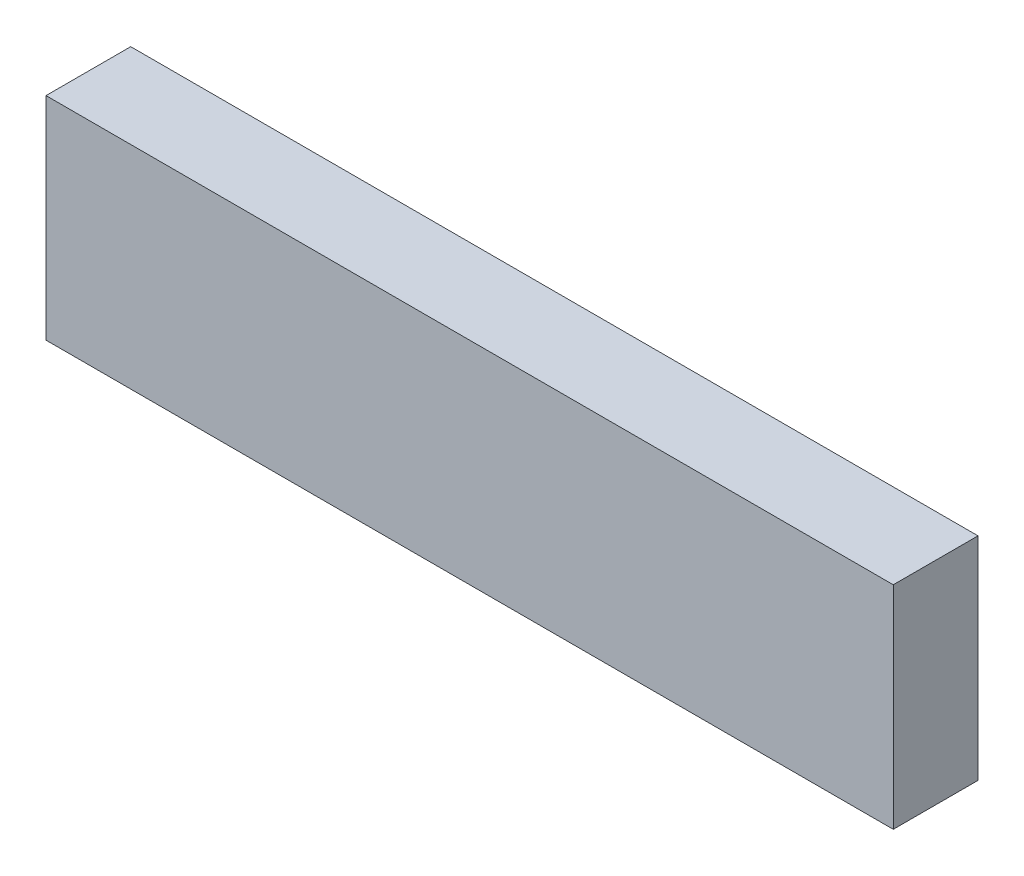
ISO-10303-21;
HEADER;
FILE_DESCRIPTION(('STEP AP214'),'2;1');
FILE_NAME('part.step','',(''),(''),'','','');
FILE_SCHEMA(('AUTOMOTIVE_DESIGN { 1 0 10303 214 1 1 1 1 }'));
ENDSEC;
DATA;
#1=APPLICATION_CONTEXT('core data for automotive mechanical design processes');
#2=APPLICATION_PROTOCOL_DEFINITION('international standard','automotive_design',2000,#1);
#3=PRODUCT_CONTEXT('',#1,'mechanical');
#4=PRODUCT('Part','Part','',(#3));
#5=PRODUCT_RELATED_PRODUCT_CATEGORY('part','',(#4));
#6=PRODUCT_DEFINITION_FORMATION('','',#4);
#7=PRODUCT_DEFINITION_CONTEXT('part definition',#1,'design');
#8=PRODUCT_DEFINITION('design','',#6,#7);
#9=PRODUCT_DEFINITION_SHAPE('','',#8);
#10=(LENGTH_UNIT() NAMED_UNIT(*) SI_UNIT(.MILLI.,.METRE.));
#11=(NAMED_UNIT(*) PLANE_ANGLE_UNIT() SI_UNIT($,.RADIAN.));
#12=(NAMED_UNIT(*) SI_UNIT($,.STERADIAN.) SOLID_ANGLE_UNIT());
#13=UNCERTAINTY_MEASURE_WITH_UNIT(LENGTH_MEASURE(1.E-05),#10,'distance_accuracy_value','');
#14=(GEOMETRIC_REPRESENTATION_CONTEXT(3) GLOBAL_UNCERTAINTY_ASSIGNED_CONTEXT((#13)) GLOBAL_UNIT_ASSIGNED_CONTEXT((#10,
#11,#12)) REPRESENTATION_CONTEXT('',''));
#15=CARTESIAN_POINT('',(0.,0.,0.));
#16=DIRECTION('',(0.,0.,1.));
#17=DIRECTION('',(1.,0.,0.));
#18=AXIS2_PLACEMENT_3D('',#15,#16,#17);
#19=CARTESIAN_POINT('',(-210.,-50.01,55.8));
#20=DIRECTION('',(0.,0.,-1.));
#21=DIRECTION('',(-1.,0.,0.));
#22=AXIS2_PLACEMENT_3D('',#19,#20,#21);
#23=PLANE('',#22);
#24=DIRECTION('',(0.,1.,0.));
#25=VECTOR('',#24,1.);
#26=CARTESIAN_POINT('',(-210.,-50.01,55.8));
#27=LINE('',#26,#25);
#28=CARTESIAN_POINT('',(-210.,-50.,55.8));
#29=VERTEX_POINT('',#28);
#30=CARTESIAN_POINT('',(-210.,-47.,55.8));
#31=VERTEX_POINT('',#30);
#32=EDGE_CURVE('E43',#29,#31,#27,.T.);
#33=ORIENTED_EDGE('',*,*,#32,.T.);
#34=DIRECTION('',(1.,0.,0.));
#35=VECTOR('',#34,1.);
#36=CARTESIAN_POINT('',(-300.,-47.,55.8));
#37=LINE('',#36,#35);
#38=CARTESIAN_POINT('',(-198.,-47.,55.8));
#39=VERTEX_POINT('',#38);
#40=EDGE_CURVE('E92',#31,#39,#37,.T.);
#41=ORIENTED_EDGE('',*,*,#40,.T.);
#42=DIRECTION('',(0.,1.,0.));
#43=VECTOR('',#42,1.);
#44=CARTESIAN_POINT('',(-198.,-50.01,55.8));
#45=LINE('',#44,#43);
#46=CARTESIAN_POINT('',(-198.,-50.,55.8));
#47=VERTEX_POINT('',#46);
#48=EDGE_CURVE('E11',#47,#39,#45,.T.);
#49=ORIENTED_EDGE('',*,*,#48,.F.);
#50=DIRECTION('',(-1.,0.,0.));
#51=VECTOR('',#50,1.);
#52=CARTESIAN_POINT('',(-300.,-50.,55.8));
#53=LINE('',#52,#51);
#54=EDGE_CURVE('E96',#47,#29,#53,.T.);
#55=ORIENTED_EDGE('',*,*,#54,.T.);
#56=EDGE_LOOP('',(#33,#41,#49,#55));
#57=FACE_BOUND('',#56,.T.);
#58=ADVANCED_FACE('F35',(#57),#23,.T.);
#59=CARTESIAN_POINT('',(-210.,-50.01,55.8));
#60=DIRECTION('',(-1.,0.,0.));
#61=DIRECTION('',(0.,0.,1.));
#62=AXIS2_PLACEMENT_3D('',#59,#60,#61);
#63=PLANE('',#62);
#64=DIRECTION('',(0.,1.,0.));
#65=VECTOR('',#64,1.);
#66=CARTESIAN_POINT('',(-210.,-50.01,57.));
#67=LINE('',#66,#65);
#68=CARTESIAN_POINT('',(-210.,-50.,57.));
#69=VERTEX_POINT('',#68);
#70=CARTESIAN_POINT('',(-210.,-47.,57.));
#71=VERTEX_POINT('',#70);
#72=EDGE_CURVE('E71',#69,#71,#67,.T.);
#73=ORIENTED_EDGE('',*,*,#72,.T.);
#74=DIRECTION('',(0.,0.,-1.));
#75=VECTOR('',#74,1.);
#76=CARTESIAN_POINT('',(-210.,-47.,3.));
#77=LINE('',#76,#75);
#78=EDGE_CURVE('E75',#71,#31,#77,.T.);
#79=ORIENTED_EDGE('',*,*,#78,.T.);
#80=ORIENTED_EDGE('',*,*,#32,.F.);
#81=DIRECTION('',(0.,0.,1.));
#82=VECTOR('',#81,1.);
#83=CARTESIAN_POINT('',(-210.,-50.,60.));
#84=LINE('',#83,#82);
#85=EDGE_CURVE('E77',#29,#69,#84,.T.);
#86=ORIENTED_EDGE('',*,*,#85,.T.);
#87=EDGE_LOOP('',(#73,#79,#80,#86));
#88=FACE_BOUND('',#87,.T.);
#89=ADVANCED_FACE('F73',(#88),#63,.T.);
#90=CARTESIAN_POINT('',(-198.,-50.01,55.8));
#91=DIRECTION('',(1.,0.,0.));
#92=DIRECTION('',(0.,0.,-1.));
#93=AXIS2_PLACEMENT_3D('',#90,#91,#92);
#94=PLANE('',#93);
#95=ORIENTED_EDGE('',*,*,#48,.T.);
#96=DIRECTION('',(0.,0.,1.));
#97=VECTOR('',#96,1.);
#98=CARTESIAN_POINT('',(-198.,-47.,3.));
#99=LINE('',#98,#97);
#100=CARTESIAN_POINT('',(-198.,-47.,57.));
#101=VERTEX_POINT('',#100);
#102=EDGE_CURVE('E89',#39,#101,#99,.T.);
#103=ORIENTED_EDGE('',*,*,#102,.T.);
#104=DIRECTION('',(0.,1.,0.));
#105=VECTOR('',#104,1.);
#106=CARTESIAN_POINT('',(-198.,-50.01,57.));
#107=LINE('',#106,#105);
#108=CARTESIAN_POINT('',(-198.,-50.,57.));
#109=VERTEX_POINT('',#108);
#110=EDGE_CURVE('E81',#109,#101,#107,.T.);
#111=ORIENTED_EDGE('',*,*,#110,.F.);
#112=DIRECTION('',(0.,0.,-1.));
#113=VECTOR('',#112,1.);
#114=CARTESIAN_POINT('',(-198.,-50.,60.));
#115=LINE('',#114,#113);
#116=EDGE_CURVE('E100',#109,#47,#115,.T.);
#117=ORIENTED_EDGE('',*,*,#116,.T.);
#118=EDGE_LOOP('',(#95,#103,#111,#117));
#119=FACE_BOUND('',#118,.T.);
#120=ADVANCED_FACE('F109',(#119),#94,.T.);
#121=CARTESIAN_POINT('',(-210.,-50.01,57.));
#122=DIRECTION('',(0.,0.,1.));
#123=DIRECTION('',(1.,0.,0.));
#124=AXIS2_PLACEMENT_3D('',#121,#122,#123);
#125=PLANE('',#124);
#126=ORIENTED_EDGE('',*,*,#110,.T.);
#127=DIRECTION('',(-1.,0.,0.));
#128=VECTOR('',#127,1.);
#129=CARTESIAN_POINT('',(-300.,-47.,57.));
#130=LINE('',#129,#128);
#131=EDGE_CURVE('E84',#101,#71,#130,.T.);
#132=ORIENTED_EDGE('',*,*,#131,.T.);
#133=ORIENTED_EDGE('',*,*,#72,.F.);
#134=DIRECTION('',(1.,0.,0.));
#135=VECTOR('',#134,1.);
#136=CARTESIAN_POINT('',(-300.,-50.,57.));
#137=LINE('',#136,#135);
#138=EDGE_CURVE('E103',#69,#109,#137,.T.);
#139=ORIENTED_EDGE('',*,*,#138,.T.);
#140=EDGE_LOOP('',(#126,#132,#133,#139));
#141=FACE_BOUND('',#140,.T.);
#142=ADVANCED_FACE('F85',(#141),#125,.T.);
#143=CARTESIAN_POINT('',(-300.,-50.,60.));
#144=DIRECTION('',(0.,1.,0.));
#145=DIRECTION('',(0.,0.,1.));
#146=AXIS2_PLACEMENT_3D('',#143,#144,#145);
#147=PLANE('',#146);
#148=ORIENTED_EDGE('',*,*,#85,.F.);
#149=ORIENTED_EDGE('',*,*,#54,.F.);
#150=ORIENTED_EDGE('',*,*,#116,.F.);
#151=ORIENTED_EDGE('',*,*,#138,.F.);
#152=EDGE_LOOP('',(#148,#149,#150,#151));
#153=FACE_BOUND('',#152,.T.);
#154=ADVANCED_FACE('F102',(#153),#147,.F.);
#155=CARTESIAN_POINT('',(-300.,-47.,3.));
#156=DIRECTION('',(0.,-1.,0.));
#157=DIRECTION('',(0.,0.,-1.));
#158=AXIS2_PLACEMENT_3D('',#155,#156,#157);
#159=PLANE('',#158);
#160=ORIENTED_EDGE('',*,*,#78,.F.);
#161=ORIENTED_EDGE('',*,*,#131,.F.);
#162=ORIENTED_EDGE('',*,*,#102,.F.);
#163=ORIENTED_EDGE('',*,*,#40,.F.);
#164=EDGE_LOOP('',(#160,#161,#162,#163));
#165=FACE_BOUND('',#164,.T.);
#166=ADVANCED_FACE('F37',(#165),#159,.F.);
#167=CLOSED_SHELL('',(#58,#89,#120,#142,#154,#166));
#168=MANIFOLD_SOLID_BREP('B2',#167);
#169=ADVANCED_BREP_SHAPE_REPRESENTATION('',(#18,#168),#14);
#170=SHAPE_DEFINITION_REPRESENTATION(#9,#169);
ENDSEC;
END-ISO-10303-21;
